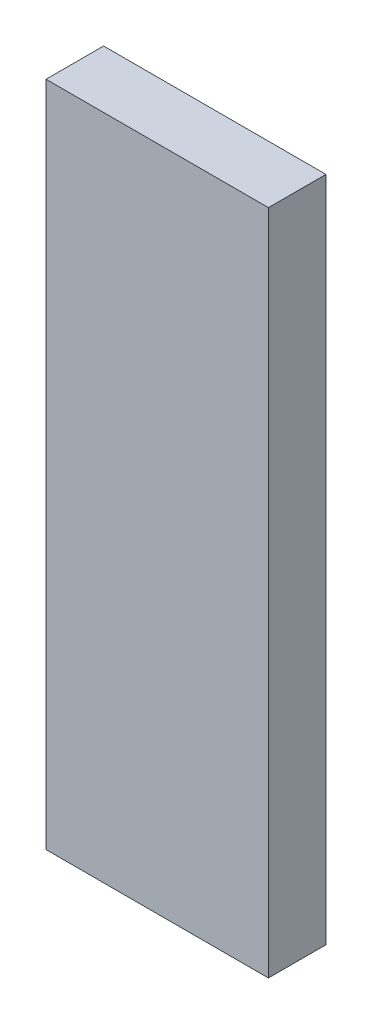
ISO-10303-21;
HEADER;
FILE_DESCRIPTION(('STEP AP214'),'2;1');
FILE_NAME('part.step','',(''),(''),'','','');
FILE_SCHEMA(('AUTOMOTIVE_DESIGN { 1 0 10303 214 1 1 1 1 }'));
ENDSEC;
DATA;
#1=APPLICATION_CONTEXT('core data for automotive mechanical design processes');
#2=APPLICATION_PROTOCOL_DEFINITION('international standard','automotive_design',2000,#1);
#3=PRODUCT_CONTEXT('',#1,'mechanical');
#4=PRODUCT('Part','Part','',(#3));
#5=PRODUCT_RELATED_PRODUCT_CATEGORY('part','',(#4));
#6=PRODUCT_DEFINITION_FORMATION('','',#4);
#7=PRODUCT_DEFINITION_CONTEXT('part definition',#1,'design');
#8=PRODUCT_DEFINITION('design','',#6,#7);
#9=PRODUCT_DEFINITION_SHAPE('','',#8);
#10=(LENGTH_UNIT() NAMED_UNIT(*) SI_UNIT(.MILLI.,.METRE.));
#11=(NAMED_UNIT(*) PLANE_ANGLE_UNIT() SI_UNIT($,.RADIAN.));
#12=(NAMED_UNIT(*) SI_UNIT($,.STERADIAN.) SOLID_ANGLE_UNIT());
#13=UNCERTAINTY_MEASURE_WITH_UNIT(LENGTH_MEASURE(1.E-05),#10,'distance_accuracy_value','');
#14=(GEOMETRIC_REPRESENTATION_CONTEXT(3) GLOBAL_UNCERTAINTY_ASSIGNED_CONTEXT((#13)) GLOBAL_UNIT_ASSIGNED_CONTEXT((#10,
#11,#12)) REPRESENTATION_CONTEXT('',''));
#15=CARTESIAN_POINT('',(0.,0.,0.));
#16=DIRECTION('',(0.,0.,1.));
#17=DIRECTION('',(1.,0.,0.));
#18=AXIS2_PLACEMENT_3D('',#15,#16,#17);
#19=CARTESIAN_POINT('',(-16.1150000000001,19.049999999984,3.28675999999639));
#20=DIRECTION('',(-1.,0.,0.));
#21=DIRECTION('',(0.,-1.,0.));
#22=AXIS2_PLACEMENT_3D('',#19,#20,#21);
#23=PLANE('',#22);
#24=DIRECTION('',(0.,1.,0.));
#25=VECTOR('',#24,1.);
#26=CARTESIAN_POINT('',(-16.1149999999999,19.0499999999876,-6.21724893790088E-12));
#27=LINE('',#26,#25);
#28=CARTESIAN_POINT('',(-16.1149999999979,-19.0500000000178,-1.4210854715202E-11));
#29=VERTEX_POINT('',#28);
#30=CARTESIAN_POINT('',(-16.1149999999999,19.0499999999876,-6.21724893790088E-12));
#31=VERTEX_POINT('',#30);
#32=EDGE_CURVE('E97',#29,#31,#27,.T.);
#33=ORIENTED_EDGE('',*,*,#32,.T.);
#34=DIRECTION('',(0.,0.,-1.));
#35=VECTOR('',#34,1.);
#36=CARTESIAN_POINT('',(-16.1150000000001,19.049999999984,3.28675999999639));
#37=LINE('',#36,#35);
#38=CARTESIAN_POINT('',(-16.1150000000001,19.049999999984,3.28675999999639));
#39=VERTEX_POINT('',#38);
#40=EDGE_CURVE('E11',#39,#31,#37,.T.);
#41=ORIENTED_EDGE('',*,*,#40,.F.);
#42=DIRECTION('',(0.,1.,0.));
#43=VECTOR('',#42,1.);
#44=CARTESIAN_POINT('',(-16.1150000000001,19.049999999984,3.28675999999639));
#45=LINE('',#44,#43);
#46=CARTESIAN_POINT('',(-16.1149999999979,-19.0500000000116,3.28675999999373));
#47=VERTEX_POINT('',#46);
#48=EDGE_CURVE('E85',#47,#39,#45,.T.);
#49=ORIENTED_EDGE('',*,*,#48,.F.);
#50=DIRECTION('',(0.,0.,-1.));
#51=VECTOR('',#50,1.);
#52=CARTESIAN_POINT('',(-16.1149999999979,-19.0500000000116,3.28675999999373));
#53=LINE('',#52,#51);
#54=EDGE_CURVE('E93',#47,#29,#53,.T.);
#55=ORIENTED_EDGE('',*,*,#54,.T.);
#56=EDGE_LOOP('',(#33,#41,#49,#55));
#57=FACE_BOUND('',#56,.T.);
#58=ADVANCED_FACE('F34',(#57),#23,.F.);
#59=CARTESIAN_POINT('',(-16.1150000000001,19.049999999984,3.28675999999639));
#60=DIRECTION('',(0.,-1.,0.));
#61=DIRECTION('',(1.,0.,0.));
#62=AXIS2_PLACEMENT_3D('',#59,#60,#61);
#63=PLANE('',#62);
#64=DIRECTION('',(-1.,0.,0.));
#65=VECTOR('',#64,1.);
#66=CARTESIAN_POINT('',(-16.1149999999999,19.0499999999876,-6.21724893790088E-12));
#67=LINE('',#66,#65);
#68=CARTESIAN_POINT('',(-28.815,19.0499999999876,-6.21724893790088E-12));
#69=VERTEX_POINT('',#68);
#70=EDGE_CURVE('E89',#31,#69,#67,.T.);
#71=ORIENTED_EDGE('',*,*,#70,.T.);
#72=DIRECTION('',(0.,0.,-1.));
#73=VECTOR('',#72,1.);
#74=CARTESIAN_POINT('',(-28.815,19.049999999984,3.28675999999639));
#75=LINE('',#74,#73);
#76=CARTESIAN_POINT('',(-28.815,19.049999999984,3.28675999999639));
#77=VERTEX_POINT('',#76);
#78=EDGE_CURVE('E42',#77,#69,#75,.T.);
#79=ORIENTED_EDGE('',*,*,#78,.F.);
#80=DIRECTION('',(-1.,0.,0.));
#81=VECTOR('',#80,1.);
#82=CARTESIAN_POINT('',(-16.1150000000001,19.049999999984,3.28675999999639));
#83=LINE('',#82,#81);
#84=EDGE_CURVE('E80',#39,#77,#83,.T.);
#85=ORIENTED_EDGE('',*,*,#84,.F.);
#86=ORIENTED_EDGE('',*,*,#40,.T.);
#87=EDGE_LOOP('',(#71,#79,#85,#86));
#88=FACE_BOUND('',#87,.T.);
#89=ADVANCED_FACE('F88',(#88),#63,.F.);
#90=CARTESIAN_POINT('',(-28.815,19.049999999984,3.28675999999639));
#91=DIRECTION('',(1.,0.,0.));
#92=DIRECTION('',(0.,1.,0.));
#93=AXIS2_PLACEMENT_3D('',#90,#91,#92);
#94=PLANE('',#93);
#95=DIRECTION('',(0.,-1.,0.));
#96=VECTOR('',#95,1.);
#97=CARTESIAN_POINT('',(-28.815,19.0499999999876,-6.21724893790088E-12));
#98=LINE('',#97,#96);
#99=CARTESIAN_POINT('',(-28.8149999999979,-19.0500000000169,-1.33226762955019E-11));
#100=VERTEX_POINT('',#99);
#101=EDGE_CURVE('E67',#69,#100,#98,.T.);
#102=ORIENTED_EDGE('',*,*,#101,.T.);
#103=DIRECTION('',(0.,0.,-1.));
#104=VECTOR('',#103,1.);
#105=CARTESIAN_POINT('',(-28.814999999998,-19.0500000000116,3.28675999999373));
#106=LINE('',#105,#104);
#107=CARTESIAN_POINT('',(-28.814999999998,-19.0500000000116,3.28675999999373));
#108=VERTEX_POINT('',#107);
#109=EDGE_CURVE('E90',#108,#100,#106,.T.);
#110=ORIENTED_EDGE('',*,*,#109,.F.);
#111=DIRECTION('',(0.,-1.,0.));
#112=VECTOR('',#111,1.);
#113=CARTESIAN_POINT('',(-28.815,19.049999999984,3.28675999999639));
#114=LINE('',#113,#112);
#115=EDGE_CURVE('E83',#77,#108,#114,.T.);
#116=ORIENTED_EDGE('',*,*,#115,.F.);
#117=ORIENTED_EDGE('',*,*,#78,.T.);
#118=EDGE_LOOP('',(#102,#110,#116,#117));
#119=FACE_BOUND('',#118,.T.);
#120=ADVANCED_FACE('F91',(#119),#94,.F.);
#121=CARTESIAN_POINT('',(-16.1149999999979,-19.0500000000116,3.28675999999373));
#122=DIRECTION('',(0.,1.,0.));
#123=DIRECTION('',(-1.,0.,0.));
#124=AXIS2_PLACEMENT_3D('',#121,#122,#123);
#125=PLANE('',#124);
#126=DIRECTION('',(1.,0.,0.));
#127=VECTOR('',#126,1.);
#128=CARTESIAN_POINT('',(-16.1149999999979,-19.0500000000178,-1.4210854715202E-11));
#129=LINE('',#128,#127);
#130=EDGE_CURVE('E73',#100,#29,#129,.T.);
#131=ORIENTED_EDGE('',*,*,#130,.T.);
#132=ORIENTED_EDGE('',*,*,#54,.F.);
#133=DIRECTION('',(1.,0.,0.));
#134=VECTOR('',#133,1.);
#135=CARTESIAN_POINT('',(-16.1149999999979,-19.0500000000116,3.28675999999373));
#136=LINE('',#135,#134);
#137=EDGE_CURVE('E50',#108,#47,#136,.T.);
#138=ORIENTED_EDGE('',*,*,#137,.F.);
#139=ORIENTED_EDGE('',*,*,#109,.T.);
#140=EDGE_LOOP('',(#131,#132,#138,#139));
#141=FACE_BOUND('',#140,.T.);
#142=ADVANCED_FACE('F104',(#141),#125,.F.);
#143=CARTESIAN_POINT('',(0.,-1.59872115546023E-11,3.28675999999373));
#144=DIRECTION('',(0.,0.,-1.));
#145=DIRECTION('',(-1.,0.,0.));
#146=AXIS2_PLACEMENT_3D('',#143,#144,#145);
#147=PLANE('',#146);
#148=ORIENTED_EDGE('',*,*,#48,.T.);
#149=ORIENTED_EDGE('',*,*,#84,.T.);
#150=ORIENTED_EDGE('',*,*,#115,.T.);
#151=ORIENTED_EDGE('',*,*,#137,.T.);
#152=EDGE_LOOP('',(#148,#149,#150,#151));
#153=FACE_BOUND('',#152,.T.);
#154=ADVANCED_FACE('F81',(#153),#147,.F.);
#155=CARTESIAN_POINT('',(0.,0.,0.));
#156=DIRECTION('',(0.,0.,-1.));
#157=DIRECTION('',(-1.,0.,0.));
#158=AXIS2_PLACEMENT_3D('',#155,#156,#157);
#159=PLANE('',#158);
#160=ORIENTED_EDGE('',*,*,#32,.F.);
#161=ORIENTED_EDGE('',*,*,#130,.F.);
#162=ORIENTED_EDGE('',*,*,#101,.F.);
#163=ORIENTED_EDGE('',*,*,#70,.F.);
#164=EDGE_LOOP('',(#160,#161,#162,#163));
#165=FACE_BOUND('',#164,.T.);
#166=ADVANCED_FACE('F107',(#165),#159,.T.);
#167=CLOSED_SHELL('',(#58,#89,#120,#142,#154,#166));
#168=MANIFOLD_SOLID_BREP('B2',#167);
#169=ADVANCED_BREP_SHAPE_REPRESENTATION('',(#18,#168),#14);
#170=SHAPE_DEFINITION_REPRESENTATION(#9,#169);
ENDSEC;
END-ISO-10303-21;
